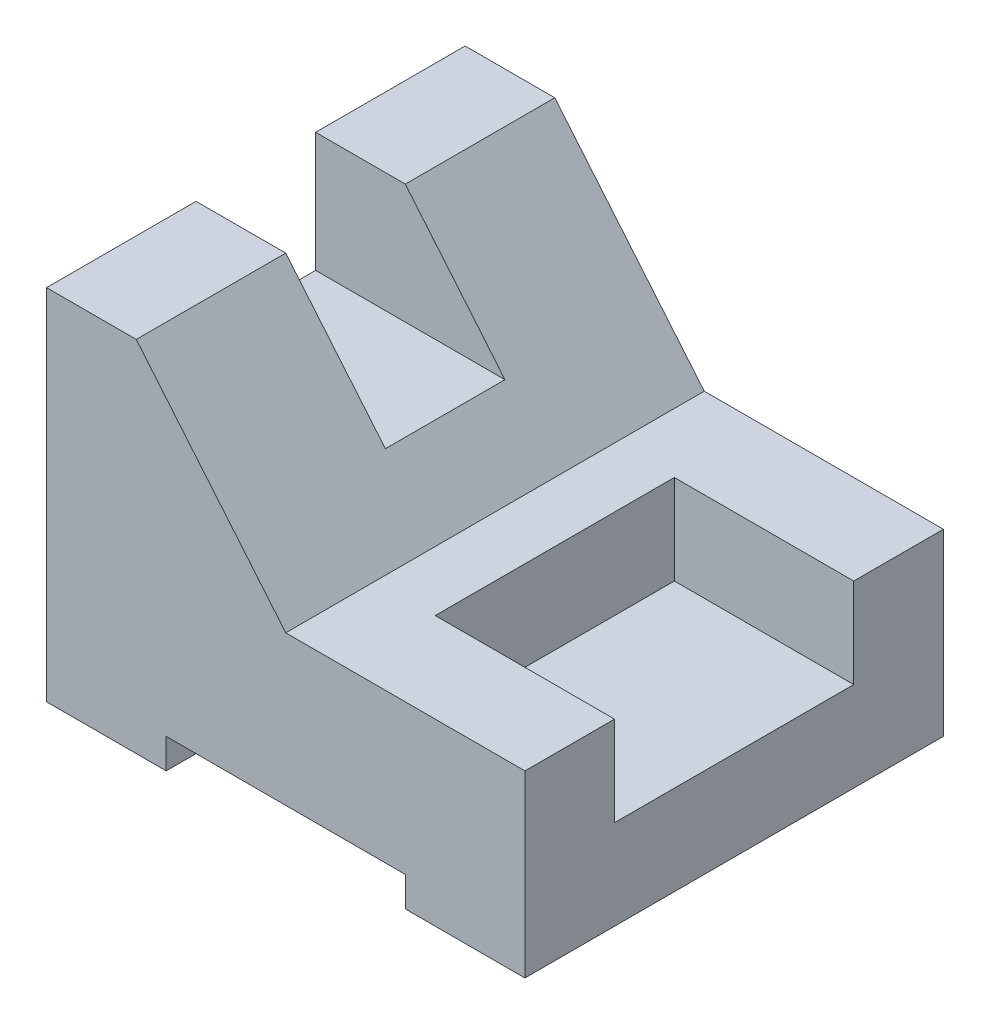
ISO-10303-21;
HEADER;
FILE_DESCRIPTION(('STEP AP214'),'2;1');
FILE_NAME('part.step','',(''),(''),'','','');
FILE_SCHEMA(('AUTOMOTIVE_DESIGN { 1 0 10303 214 1 1 1 1 }'));
ENDSEC;
DATA;
#1=APPLICATION_CONTEXT('core data for automotive mechanical design processes');
#2=APPLICATION_PROTOCOL_DEFINITION('international standard','automotive_design',2000,#1);
#3=PRODUCT_CONTEXT('',#1,'mechanical');
#4=PRODUCT('Part','Part','',(#3));
#5=PRODUCT_RELATED_PRODUCT_CATEGORY('part','',(#4));
#6=PRODUCT_DEFINITION_FORMATION('','',#4);
#7=PRODUCT_DEFINITION_CONTEXT('part definition',#1,'design');
#8=PRODUCT_DEFINITION('design','',#6,#7);
#9=PRODUCT_DEFINITION_SHAPE('','',#8);
#10=(LENGTH_UNIT() NAMED_UNIT(*) SI_UNIT(.MILLI.,.METRE.));
#11=(NAMED_UNIT(*) PLANE_ANGLE_UNIT() SI_UNIT($,.RADIAN.));
#12=(NAMED_UNIT(*) SI_UNIT($,.STERADIAN.) SOLID_ANGLE_UNIT());
#13=UNCERTAINTY_MEASURE_WITH_UNIT(LENGTH_MEASURE(1.E-05),#10,'distance_accuracy_value','');
#14=(GEOMETRIC_REPRESENTATION_CONTEXT(3) GLOBAL_UNCERTAINTY_ASSIGNED_CONTEXT((#13)) GLOBAL_UNIT_ASSIGNED_CONTEXT((#10,
#11,#12)) REPRESENTATION_CONTEXT('',''));
#15=CARTESIAN_POINT('',(0.,0.,0.));
#16=DIRECTION('',(0.,0.,1.));
#17=DIRECTION('',(1.,0.,0.));
#18=AXIS2_PLACEMENT_3D('',#15,#16,#17);
#19=CARTESIAN_POINT('',(0.,60.,35.));
#20=DIRECTION('',(0.,-1.,0.));
#21=DIRECTION('',(0.,0.,-1.));
#22=AXIS2_PLACEMENT_3D('',#19,#20,#21);
#23=PLANE('',#22);
#24=DIRECTION('',(-1.,0.,0.));
#25=VECTOR('',#24,1.);
#26=CARTESIAN_POINT('',(15.,60.,10.));
#27=LINE('',#26,#25);
#28=CARTESIAN_POINT('',(15.,60.,10.));
#29=VERTEX_POINT('',#28);
#30=CARTESIAN_POINT('',(0.,60.,10.));
#31=VERTEX_POINT('',#30);
#32=EDGE_CURVE('E203',#29,#31,#27,.T.);
#33=ORIENTED_EDGE('',*,*,#32,.T.);
#34=DIRECTION('',(0.,0.,-1.));
#35=VECTOR('',#34,1.);
#36=CARTESIAN_POINT('',(0.,60.,35.));
#37=LINE('',#36,#35);
#38=CARTESIAN_POINT('',(0.,60.,35.));
#39=VERTEX_POINT('',#38);
#40=EDGE_CURVE('E261',#39,#31,#37,.T.);
#41=ORIENTED_EDGE('',*,*,#40,.F.);
#42=DIRECTION('',(-1.,0.,0.));
#43=VECTOR('',#42,1.);
#44=CARTESIAN_POINT('',(0.,60.,35.));
#45=LINE('',#44,#43);
#46=CARTESIAN_POINT('',(15.,60.,35.));
#47=VERTEX_POINT('',#46);
#48=EDGE_CURVE('E231',#47,#39,#45,.T.);
#49=ORIENTED_EDGE('',*,*,#48,.F.);
#50=DIRECTION('',(0.,0.,-1.));
#51=VECTOR('',#50,1.);
#52=CARTESIAN_POINT('',(15.,60.,35.));
#53=LINE('',#52,#51);
#54=EDGE_CURVE('E265',#47,#29,#53,.T.);
#55=ORIENTED_EDGE('',*,*,#54,.T.);
#56=EDGE_LOOP('',(#33,#41,#49,#55));
#57=FACE_BOUND('',#56,.T.);
#58=ADVANCED_FACE('F33',(#57),#23,.F.);
#59=CARTESIAN_POINT('',(0.,0.,35.));
#60=DIRECTION('',(0.,1.,0.));
#61=DIRECTION('',(0.,0.,1.));
#62=AXIS2_PLACEMENT_3D('',#59,#60,#61);
#63=PLANE('',#62);
#64=DIRECTION('',(1.,0.,0.));
#65=VECTOR('',#64,1.);
#66=CARTESIAN_POINT('',(0.,0.,-35.));
#67=LINE('',#66,#65);
#68=CARTESIAN_POINT('',(0.,0.,-35.));
#69=VERTEX_POINT('',#68);
#70=CARTESIAN_POINT('',(20.,0.,-35.));
#71=VERTEX_POINT('',#70);
#72=EDGE_CURVE('E210',#69,#71,#67,.T.);
#73=ORIENTED_EDGE('',*,*,#72,.T.);
#74=DIRECTION('',(0.,0.,-1.));
#75=VECTOR('',#74,1.);
#76=CARTESIAN_POINT('',(20.,0.,35.));
#77=LINE('',#76,#75);
#78=CARTESIAN_POINT('',(20.,0.,35.));
#79=VERTEX_POINT('',#78);
#80=EDGE_CURVE('E11',#79,#71,#77,.T.);
#81=ORIENTED_EDGE('',*,*,#80,.F.);
#82=DIRECTION('',(1.,0.,0.));
#83=VECTOR('',#82,1.);
#84=CARTESIAN_POINT('',(0.,0.,35.));
#85=LINE('',#84,#83);
#86=CARTESIAN_POINT('',(0.,0.,35.));
#87=VERTEX_POINT('',#86);
#88=EDGE_CURVE('E213',#87,#79,#85,.T.);
#89=ORIENTED_EDGE('',*,*,#88,.F.);
#90=DIRECTION('',(0.,0.,-1.));
#91=VECTOR('',#90,1.);
#92=CARTESIAN_POINT('',(0.,0.,35.));
#93=LINE('',#92,#91);
#94=EDGE_CURVE('E235',#87,#69,#93,.T.);
#95=ORIENTED_EDGE('',*,*,#94,.T.);
#96=EDGE_LOOP('',(#73,#81,#89,#95));
#97=FACE_BOUND('',#96,.T.);
#98=ADVANCED_FACE('F35',(#97),#63,.F.);
#99=CARTESIAN_POINT('',(20.,0.,35.));
#100=DIRECTION('',(-1.,0.,0.));
#101=DIRECTION('',(0.,0.,1.));
#102=AXIS2_PLACEMENT_3D('',#99,#100,#101);
#103=PLANE('',#102);
#104=DIRECTION('',(0.,1.,0.));
#105=VECTOR('',#104,1.);
#106=CARTESIAN_POINT('',(20.,0.,-35.));
#107=LINE('',#106,#105);
#108=CARTESIAN_POINT('',(20.,5.,-35.));
#109=VERTEX_POINT('',#108);
#110=EDGE_CURVE('E238',#71,#109,#107,.T.);
#111=ORIENTED_EDGE('',*,*,#110,.T.);
#112=DIRECTION('',(0.,0.,-1.));
#113=VECTOR('',#112,1.);
#114=CARTESIAN_POINT('',(20.,5.,35.));
#115=LINE('',#114,#113);
#116=CARTESIAN_POINT('',(20.,5.,35.));
#117=VERTEX_POINT('',#116);
#118=EDGE_CURVE('E41',#117,#109,#115,.T.);
#119=ORIENTED_EDGE('',*,*,#118,.F.);
#120=DIRECTION('',(0.,1.,0.));
#121=VECTOR('',#120,1.);
#122=CARTESIAN_POINT('',(20.,0.,35.));
#123=LINE('',#122,#121);
#124=EDGE_CURVE('E216',#79,#117,#123,.T.);
#125=ORIENTED_EDGE('',*,*,#124,.F.);
#126=ORIENTED_EDGE('',*,*,#80,.T.);
#127=EDGE_LOOP('',(#111,#119,#125,#126));
#128=FACE_BOUND('',#127,.T.);
#129=ADVANCED_FACE('F310',(#128),#103,.F.);
#130=CARTESIAN_POINT('',(20.,5.,35.));
#131=DIRECTION('',(0.,1.,0.));
#132=DIRECTION('',(0.,0.,1.));
#133=AXIS2_PLACEMENT_3D('',#130,#131,#132);
#134=PLANE('',#133);
#135=DIRECTION('',(1.,0.,0.));
#136=VECTOR('',#135,1.);
#137=CARTESIAN_POINT('',(20.,5.,-35.));
#138=LINE('',#137,#136);
#139=CARTESIAN_POINT('',(60.,5.,-35.));
#140=VERTEX_POINT('',#139);
#141=EDGE_CURVE('E240',#109,#140,#138,.T.);
#142=ORIENTED_EDGE('',*,*,#141,.T.);
#143=DIRECTION('',(0.,0.,-1.));
#144=VECTOR('',#143,1.);
#145=CARTESIAN_POINT('',(60.,5.,35.));
#146=LINE('',#145,#144);
#147=CARTESIAN_POINT('',(60.,5.,35.));
#148=VERTEX_POINT('',#147);
#149=EDGE_CURVE('E280',#148,#140,#146,.T.);
#150=ORIENTED_EDGE('',*,*,#149,.F.);
#151=DIRECTION('',(1.,0.,0.));
#152=VECTOR('',#151,1.);
#153=CARTESIAN_POINT('',(20.,5.,35.));
#154=LINE('',#153,#152);
#155=EDGE_CURVE('E219',#117,#148,#154,.T.);
#156=ORIENTED_EDGE('',*,*,#155,.F.);
#157=ORIENTED_EDGE('',*,*,#118,.T.);
#158=EDGE_LOOP('',(#142,#150,#156,#157));
#159=FACE_BOUND('',#158,.T.);
#160=ADVANCED_FACE('F287',(#159),#134,.F.);
#161=CARTESIAN_POINT('',(60.,5.,35.));
#162=DIRECTION('',(1.,0.,0.));
#163=DIRECTION('',(0.,0.,-1.));
#164=AXIS2_PLACEMENT_3D('',#161,#162,#163);
#165=PLANE('',#164);
#166=DIRECTION('',(0.,-1.,0.));
#167=VECTOR('',#166,1.);
#168=CARTESIAN_POINT('',(60.,5.,-35.));
#169=LINE('',#168,#167);
#170=CARTESIAN_POINT('',(60.,0.,-35.));
#171=VERTEX_POINT('',#170);
#172=EDGE_CURVE('E242',#140,#171,#169,.T.);
#173=ORIENTED_EDGE('',*,*,#172,.T.);
#174=DIRECTION('',(0.,0.,-1.));
#175=VECTOR('',#174,1.);
#176=CARTESIAN_POINT('',(60.,0.,35.));
#177=LINE('',#176,#175);
#178=CARTESIAN_POINT('',(60.,0.,35.));
#179=VERTEX_POINT('',#178);
#180=EDGE_CURVE('E277',#179,#171,#177,.T.);
#181=ORIENTED_EDGE('',*,*,#180,.F.);
#182=DIRECTION('',(0.,-1.,0.));
#183=VECTOR('',#182,1.);
#184=CARTESIAN_POINT('',(60.,5.,35.));
#185=LINE('',#184,#183);
#186=EDGE_CURVE('E221',#148,#179,#185,.T.);
#187=ORIENTED_EDGE('',*,*,#186,.F.);
#188=ORIENTED_EDGE('',*,*,#149,.T.);
#189=EDGE_LOOP('',(#173,#181,#187,#188));
#190=FACE_BOUND('',#189,.T.);
#191=ADVANCED_FACE('F298',(#190),#165,.F.);
#192=CARTESIAN_POINT('',(60.,0.,35.));
#193=DIRECTION('',(0.,1.,0.));
#194=DIRECTION('',(0.,0.,1.));
#195=AXIS2_PLACEMENT_3D('',#192,#193,#194);
#196=PLANE('',#195);
#197=DIRECTION('',(1.,0.,0.));
#198=VECTOR('',#197,1.);
#199=CARTESIAN_POINT('',(60.,0.,-35.));
#200=LINE('',#199,#198);
#201=CARTESIAN_POINT('',(80.,0.,-35.));
#202=VERTEX_POINT('',#201);
#203=EDGE_CURVE('E244',#171,#202,#200,.T.);
#204=ORIENTED_EDGE('',*,*,#203,.T.);
#205=DIRECTION('',(0.,0.,-1.));
#206=VECTOR('',#205,1.);
#207=CARTESIAN_POINT('',(80.,0.,35.));
#208=LINE('',#207,#206);
#209=CARTESIAN_POINT('',(80.,0.,35.));
#210=VERTEX_POINT('',#209);
#211=EDGE_CURVE('E274',#210,#202,#208,.T.);
#212=ORIENTED_EDGE('',*,*,#211,.F.);
#213=DIRECTION('',(1.,0.,0.));
#214=VECTOR('',#213,1.);
#215=CARTESIAN_POINT('',(60.,0.,35.));
#216=LINE('',#215,#214);
#217=EDGE_CURVE('E223',#179,#210,#216,.T.);
#218=ORIENTED_EDGE('',*,*,#217,.F.);
#219=ORIENTED_EDGE('',*,*,#180,.T.);
#220=EDGE_LOOP('',(#204,#212,#218,#219));
#221=FACE_BOUND('',#220,.T.);
#222=ADVANCED_FACE('F302',(#221),#196,.F.);
#223=CARTESIAN_POINT('',(80.,0.,35.));
#224=DIRECTION('',(-1.,0.,0.));
#225=DIRECTION('',(0.,0.,1.));
#226=AXIS2_PLACEMENT_3D('',#223,#224,#225);
#227=PLANE('',#226);
#228=DIRECTION('',(0.,0.,-1.));
#229=VECTOR('',#228,1.);
#230=CARTESIAN_POINT('',(80.,30.,35.));
#231=LINE('',#230,#229);
#232=CARTESIAN_POINT('',(80.,30.,-20.));
#233=VERTEX_POINT('',#232);
#234=CARTESIAN_POINT('',(80.,30.,-35.));
#235=VERTEX_POINT('',#234);
#236=EDGE_CURVE('E271',#233,#235,#231,.T.);
#237=ORIENTED_EDGE('',*,*,#236,.F.);
#238=DIRECTION('',(0.,-1.,0.));
#239=VECTOR('',#238,1.);
#240=CARTESIAN_POINT('',(80.,30.,-20.));
#241=LINE('',#240,#239);
#242=CARTESIAN_POINT('',(80.,15.,-20.));
#243=VERTEX_POINT('',#242);
#244=EDGE_CURVE('E164',#233,#243,#241,.T.);
#245=ORIENTED_EDGE('',*,*,#244,.T.);
#246=DIRECTION('',(0.,0.,1.));
#247=VECTOR('',#246,1.);
#248=CARTESIAN_POINT('',(80.,15.,-20.));
#249=LINE('',#248,#247);
#250=CARTESIAN_POINT('',(80.,15.,20.));
#251=VERTEX_POINT('',#250);
#252=EDGE_CURVE('E181',#243,#251,#249,.T.);
#253=ORIENTED_EDGE('',*,*,#252,.T.);
#254=DIRECTION('',(0.,-1.,0.));
#255=VECTOR('',#254,1.);
#256=CARTESIAN_POINT('',(80.,30.,20.));
#257=LINE('',#256,#255);
#258=CARTESIAN_POINT('',(80.,30.,20.));
#259=VERTEX_POINT('',#258);
#260=EDGE_CURVE('E336',#259,#251,#257,.T.);
#261=ORIENTED_EDGE('',*,*,#260,.F.);
#262=CARTESIAN_POINT('',(80.,30.,35.));
#263=VERTEX_POINT('',#262);
#264=EDGE_CURVE('E272',#263,#259,#231,.T.);
#265=ORIENTED_EDGE('',*,*,#264,.F.);
#266=DIRECTION('',(0.,1.,0.));
#267=VECTOR('',#266,1.);
#268=CARTESIAN_POINT('',(80.,0.,35.));
#269=LINE('',#268,#267);
#270=EDGE_CURVE('E225',#210,#263,#269,.T.);
#271=ORIENTED_EDGE('',*,*,#270,.F.);
#272=ORIENTED_EDGE('',*,*,#211,.T.);
#273=DIRECTION('',(0.,1.,0.));
#274=VECTOR('',#273,1.);
#275=CARTESIAN_POINT('',(80.,0.,-35.));
#276=LINE('',#275,#274);
#277=EDGE_CURVE('E246',#202,#235,#276,.T.);
#278=ORIENTED_EDGE('',*,*,#277,.T.);
#279=EDGE_LOOP('',(#237,#245,#253,#261,#265,#271,#272,#278));
#280=FACE_BOUND('',#279,.T.);
#281=ADVANCED_FACE('F334',(#280),#227,.F.);
#282=CARTESIAN_POINT('',(80.,30.,35.));
#283=DIRECTION('',(0.,-1.,0.));
#284=DIRECTION('',(0.,0.,-1.));
#285=AXIS2_PLACEMENT_3D('',#282,#283,#284);
#286=PLANE('',#285);
#287=DIRECTION('',(0.,0.,1.));
#288=VECTOR('',#287,1.);
#289=CARTESIAN_POINT('',(50.,30.,-20.));
#290=LINE('',#289,#288);
#291=CARTESIAN_POINT('',(50.,30.,-20.));
#292=VERTEX_POINT('',#291);
#293=CARTESIAN_POINT('',(50.,30.,20.));
#294=VERTEX_POINT('',#293);
#295=EDGE_CURVE('E172',#292,#294,#290,.T.);
#296=ORIENTED_EDGE('',*,*,#295,.F.);
#297=DIRECTION('',(1.,0.,0.));
#298=VECTOR('',#297,1.);
#299=CARTESIAN_POINT('',(50.,30.,-20.));
#300=LINE('',#299,#298);
#301=EDGE_CURVE('E158',#292,#233,#300,.T.);
#302=ORIENTED_EDGE('',*,*,#301,.T.);
#303=ORIENTED_EDGE('',*,*,#236,.T.);
#304=DIRECTION('',(-1.,0.,0.));
#305=VECTOR('',#304,1.);
#306=CARTESIAN_POINT('',(80.,30.,-35.));
#307=LINE('',#306,#305);
#308=CARTESIAN_POINT('',(40.,30.,-35.));
#309=VERTEX_POINT('',#308);
#310=EDGE_CURVE('E249',#235,#309,#307,.T.);
#311=ORIENTED_EDGE('',*,*,#310,.T.);
#312=DIRECTION('',(0.,0.,-1.));
#313=VECTOR('',#312,1.);
#314=CARTESIAN_POINT('',(40.,30.,35.));
#315=LINE('',#314,#313);
#316=CARTESIAN_POINT('',(40.,30.,35.));
#317=VERTEX_POINT('',#316);
#318=EDGE_CURVE('E268',#317,#309,#315,.T.);
#319=ORIENTED_EDGE('',*,*,#318,.F.);
#320=DIRECTION('',(-1.,0.,0.));
#321=VECTOR('',#320,1.);
#322=CARTESIAN_POINT('',(80.,30.,35.));
#323=LINE('',#322,#321);
#324=EDGE_CURVE('E227',#263,#317,#323,.T.);
#325=ORIENTED_EDGE('',*,*,#324,.F.);
#326=ORIENTED_EDGE('',*,*,#264,.T.);
#327=DIRECTION('',(1.,0.,0.));
#328=VECTOR('',#327,1.);
#329=CARTESIAN_POINT('',(50.,30.,20.));
#330=LINE('',#329,#328);
#331=EDGE_CURVE('E180',#294,#259,#330,.T.);
#332=ORIENTED_EDGE('',*,*,#331,.F.);
#333=EDGE_LOOP('',(#296,#302,#303,#311,#319,#325,#326,#332));
#334=FACE_BOUND('',#333,.T.);
#335=ADVANCED_FACE('F178',(#334),#286,.F.);
#336=CARTESIAN_POINT('',(40.,30.,35.));
#337=DIRECTION('',(-0.768221279597376,-0.64018439966448,0.));
#338=DIRECTION('',(0.64018439966448,-0.768221279597376,0.));
#339=AXIS2_PLACEMENT_3D('',#336,#337,#338);
#340=PLANE('',#339);
#341=CARTESIAN_POINT('',(15.,60.,-10.));
#342=VERTEX_POINT('',#341);
#343=CARTESIAN_POINT('',(15.,60.,-35.));
#344=VERTEX_POINT('',#343);
#345=EDGE_CURVE('E264',#342,#344,#53,.T.);
#346=ORIENTED_EDGE('',*,*,#345,.F.);
#347=DIRECTION('',(-0.64018439966448,0.768221279597376,0.));
#348=VECTOR('',#347,1.);
#349=CARTESIAN_POINT('',(31.6666666666667,40.,-10.));
#350=LINE('',#349,#348);
#351=CARTESIAN_POINT('',(31.6666666666667,40.,-10.));
#352=VERTEX_POINT('',#351);
#353=EDGE_CURVE('E192',#352,#342,#350,.T.);
#354=ORIENTED_EDGE('',*,*,#353,.F.);
#355=DIRECTION('',(0.,0.,1.));
#356=VECTOR('',#355,1.);
#357=CARTESIAN_POINT('',(31.6666666666667,40.,-10.));
#358=LINE('',#357,#356);
#359=CARTESIAN_POINT('',(31.6666666666667,40.,10.));
#360=VERTEX_POINT('',#359);
#361=EDGE_CURVE('E199',#352,#360,#358,.T.);
#362=ORIENTED_EDGE('',*,*,#361,.T.);
#363=DIRECTION('',(-0.64018439966448,0.768221279597376,0.));
#364=VECTOR('',#363,1.);
#365=CARTESIAN_POINT('',(31.6666666666667,40.,10.));
#366=LINE('',#365,#364);
#367=EDGE_CURVE('E183',#360,#29,#366,.T.);
#368=ORIENTED_EDGE('',*,*,#367,.T.);
#369=ORIENTED_EDGE('',*,*,#54,.F.);
#370=DIRECTION('',(-0.64018439966448,0.768221279597376,0.));
#371=VECTOR('',#370,1.);
#372=CARTESIAN_POINT('',(40.,30.,35.));
#373=LINE('',#372,#371);
#374=EDGE_CURVE('E229',#317,#47,#373,.T.);
#375=ORIENTED_EDGE('',*,*,#374,.F.);
#376=ORIENTED_EDGE('',*,*,#318,.T.);
#377=DIRECTION('',(-0.64018439966448,0.768221279597376,0.));
#378=VECTOR('',#377,1.);
#379=CARTESIAN_POINT('',(40.,30.,-35.));
#380=LINE('',#379,#378);
#381=EDGE_CURVE('E251',#309,#344,#380,.T.);
#382=ORIENTED_EDGE('',*,*,#381,.T.);
#383=EDGE_LOOP('',(#346,#354,#362,#368,#369,#375,#376,#382));
#384=FACE_BOUND('',#383,.T.);
#385=ADVANCED_FACE('F328',(#384),#340,.F.);
#386=CARTESIAN_POINT('',(0.,60.,-10.));
#387=VERTEX_POINT('',#386);
#388=CARTESIAN_POINT('',(0.,60.,-35.));
#389=VERTEX_POINT('',#388);
#390=EDGE_CURVE('E260',#387,#389,#37,.T.);
#391=ORIENTED_EDGE('',*,*,#390,.F.);
#392=DIRECTION('',(-1.,0.,0.));
#393=VECTOR('',#392,1.);
#394=CARTESIAN_POINT('',(15.,60.,-10.));
#395=LINE('',#394,#393);
#396=EDGE_CURVE('E195',#342,#387,#395,.T.);
#397=ORIENTED_EDGE('',*,*,#396,.F.);
#398=ORIENTED_EDGE('',*,*,#345,.T.);
#399=DIRECTION('',(-1.,0.,0.));
#400=VECTOR('',#399,1.);
#401=CARTESIAN_POINT('',(0.,60.,-35.));
#402=LINE('',#401,#400);
#403=EDGE_CURVE('E254',#344,#389,#402,.T.);
#404=ORIENTED_EDGE('',*,*,#403,.T.);
#405=EDGE_LOOP('',(#391,#397,#398,#404));
#406=FACE_BOUND('',#405,.T.);
#407=ADVANCED_FACE('F324',(#406),#23,.F.);
#408=CARTESIAN_POINT('',(0.,0.,35.));
#409=DIRECTION('',(1.,0.,0.));
#410=DIRECTION('',(0.,0.,-1.));
#411=AXIS2_PLACEMENT_3D('',#408,#409,#410);
#412=PLANE('',#411);
#413=DIRECTION('',(0.,0.,1.));
#414=VECTOR('',#413,1.);
#415=CARTESIAN_POINT('',(0.,40.,-10.));
#416=LINE('',#415,#414);
#417=CARTESIAN_POINT('',(0.,40.,-10.));
#418=VERTEX_POINT('',#417);
#419=CARTESIAN_POINT('',(0.,40.,10.));
#420=VERTEX_POINT('',#419);
#421=EDGE_CURVE('E208',#418,#420,#416,.T.);
#422=ORIENTED_EDGE('',*,*,#421,.F.);
#423=DIRECTION('',(0.,-1.,0.));
#424=VECTOR('',#423,1.);
#425=CARTESIAN_POINT('',(0.,60.,-10.));
#426=LINE('',#425,#424);
#427=EDGE_CURVE('E197',#387,#418,#426,.T.);
#428=ORIENTED_EDGE('',*,*,#427,.F.);
#429=ORIENTED_EDGE('',*,*,#390,.T.);
#430=DIRECTION('',(0.,-1.,0.));
#431=VECTOR('',#430,1.);
#432=CARTESIAN_POINT('',(0.,0.,-35.));
#433=LINE('',#432,#431);
#434=EDGE_CURVE('E217',#389,#69,#433,.T.);
#435=ORIENTED_EDGE('',*,*,#434,.T.);
#436=ORIENTED_EDGE('',*,*,#94,.F.);
#437=DIRECTION('',(0.,-1.,0.));
#438=VECTOR('',#437,1.);
#439=CARTESIAN_POINT('',(0.,0.,35.));
#440=LINE('',#439,#438);
#441=EDGE_CURVE('E233',#39,#87,#440,.T.);
#442=ORIENTED_EDGE('',*,*,#441,.F.);
#443=ORIENTED_EDGE('',*,*,#40,.T.);
#444=DIRECTION('',(0.,-1.,0.));
#445=VECTOR('',#444,1.);
#446=CARTESIAN_POINT('',(0.,60.,10.));
#447=LINE('',#446,#445);
#448=EDGE_CURVE('E193',#31,#420,#447,.T.);
#449=ORIENTED_EDGE('',*,*,#448,.T.);
#450=EDGE_LOOP('',(#422,#428,#429,#435,#436,#442,#443,#449));
#451=FACE_BOUND('',#450,.T.);
#452=ADVANCED_FACE('F318',(#451),#412,.F.);
#453=CARTESIAN_POINT('',(0.,0.,35.));
#454=DIRECTION('',(0.,0.,1.));
#455=DIRECTION('',(1.,0.,0.));
#456=AXIS2_PLACEMENT_3D('',#453,#454,#455);
#457=PLANE('',#456);
#458=ORIENTED_EDGE('',*,*,#88,.T.);
#459=ORIENTED_EDGE('',*,*,#124,.T.);
#460=ORIENTED_EDGE('',*,*,#155,.T.);
#461=ORIENTED_EDGE('',*,*,#186,.T.);
#462=ORIENTED_EDGE('',*,*,#217,.T.);
#463=ORIENTED_EDGE('',*,*,#270,.T.);
#464=ORIENTED_EDGE('',*,*,#324,.T.);
#465=ORIENTED_EDGE('',*,*,#374,.T.);
#466=ORIENTED_EDGE('',*,*,#48,.T.);
#467=ORIENTED_EDGE('',*,*,#441,.T.);
#468=EDGE_LOOP('',(#458,#459,#460,#461,#462,#463,#464,#465,#466,#467));
#469=FACE_BOUND('',#468,.T.);
#470=ADVANCED_FACE('F306',(#469),#457,.T.);
#471=CARTESIAN_POINT('',(0.,0.,-35.));
#472=DIRECTION('',(0.,0.,1.));
#473=DIRECTION('',(1.,0.,0.));
#474=AXIS2_PLACEMENT_3D('',#471,#472,#473);
#475=PLANE('',#474);
#476=ORIENTED_EDGE('',*,*,#72,.F.);
#477=ORIENTED_EDGE('',*,*,#434,.F.);
#478=ORIENTED_EDGE('',*,*,#403,.F.);
#479=ORIENTED_EDGE('',*,*,#381,.F.);
#480=ORIENTED_EDGE('',*,*,#310,.F.);
#481=ORIENTED_EDGE('',*,*,#277,.F.);
#482=ORIENTED_EDGE('',*,*,#203,.F.);
#483=ORIENTED_EDGE('',*,*,#172,.F.);
#484=ORIENTED_EDGE('',*,*,#141,.F.);
#485=ORIENTED_EDGE('',*,*,#110,.F.);
#486=EDGE_LOOP('',(#476,#477,#478,#479,#480,#481,#482,#483,#484,#485));
#487=FACE_BOUND('',#486,.T.);
#488=ADVANCED_FACE('F293',(#487),#475,.F.);
#489=CARTESIAN_POINT('',(0.,40.,-10.));
#490=DIRECTION('',(0.,-1.,0.));
#491=DIRECTION('',(0.,0.,-1.));
#492=AXIS2_PLACEMENT_3D('',#489,#490,#491);
#493=PLANE('',#492);
#494=DIRECTION('',(1.,0.,0.));
#495=VECTOR('',#494,1.);
#496=CARTESIAN_POINT('',(0.,40.,10.));
#497=LINE('',#496,#495);
#498=EDGE_CURVE('E56',#420,#360,#497,.T.);
#499=ORIENTED_EDGE('',*,*,#498,.T.);
#500=ORIENTED_EDGE('',*,*,#361,.F.);
#501=DIRECTION('',(1.,0.,0.));
#502=VECTOR('',#501,1.);
#503=CARTESIAN_POINT('',(0.,40.,-10.));
#504=LINE('',#503,#502);
#505=EDGE_CURVE('E189',#418,#352,#504,.T.);
#506=ORIENTED_EDGE('',*,*,#505,.F.);
#507=ORIENTED_EDGE('',*,*,#421,.T.);
#508=EDGE_LOOP('',(#499,#500,#506,#507));
#509=FACE_BOUND('',#508,.T.);
#510=ADVANCED_FACE('F343',(#509),#493,.F.);
#511=CARTESIAN_POINT('',(0.,0.,-10.));
#512=DIRECTION('',(0.,0.,-1.));
#513=DIRECTION('',(-1.,0.,0.));
#514=AXIS2_PLACEMENT_3D('',#511,#512,#513);
#515=PLANE('',#514);
#516=ORIENTED_EDGE('',*,*,#505,.T.);
#517=ORIENTED_EDGE('',*,*,#353,.T.);
#518=ORIENTED_EDGE('',*,*,#396,.T.);
#519=ORIENTED_EDGE('',*,*,#427,.T.);
#520=EDGE_LOOP('',(#516,#517,#518,#519));
#521=FACE_BOUND('',#520,.T.);
#522=ADVANCED_FACE('F345',(#521),#515,.F.);
#523=CARTESIAN_POINT('',(0.,0.,10.));
#524=DIRECTION('',(0.,0.,-1.));
#525=DIRECTION('',(-1.,0.,0.));
#526=AXIS2_PLACEMENT_3D('',#523,#524,#525);
#527=PLANE('',#526);
#528=ORIENTED_EDGE('',*,*,#498,.F.);
#529=ORIENTED_EDGE('',*,*,#448,.F.);
#530=ORIENTED_EDGE('',*,*,#32,.F.);
#531=ORIENTED_EDGE('',*,*,#367,.F.);
#532=EDGE_LOOP('',(#528,#529,#530,#531));
#533=FACE_BOUND('',#532,.T.);
#534=ADVANCED_FACE('F341',(#533),#527,.T.);
#535=CARTESIAN_POINT('',(50.,15.,-20.));
#536=DIRECTION('',(1.,0.,0.));
#537=DIRECTION('',(0.,0.,-1.));
#538=AXIS2_PLACEMENT_3D('',#535,#536,#537);
#539=PLANE('',#538);
#540=DIRECTION('',(0.,1.,0.));
#541=VECTOR('',#540,1.);
#542=CARTESIAN_POINT('',(50.,15.,20.));
#543=LINE('',#542,#541);
#544=CARTESIAN_POINT('',(50.,15.,20.));
#545=VERTEX_POINT('',#544);
#546=EDGE_CURVE('E48',#545,#294,#543,.T.);
#547=ORIENTED_EDGE('',*,*,#546,.F.);
#548=DIRECTION('',(0.,0.,1.));
#549=VECTOR('',#548,1.);
#550=CARTESIAN_POINT('',(50.,15.,-20.));
#551=LINE('',#550,#549);
#552=CARTESIAN_POINT('',(50.,15.,-20.));
#553=VERTEX_POINT('',#552);
#554=EDGE_CURVE('E175',#553,#545,#551,.T.);
#555=ORIENTED_EDGE('',*,*,#554,.F.);
#556=DIRECTION('',(0.,1.,0.));
#557=VECTOR('',#556,1.);
#558=CARTESIAN_POINT('',(50.,15.,-20.));
#559=LINE('',#558,#557);
#560=EDGE_CURVE('E162',#553,#292,#559,.T.);
#561=ORIENTED_EDGE('',*,*,#560,.T.);
#562=ORIENTED_EDGE('',*,*,#295,.T.);
#563=EDGE_LOOP('',(#547,#555,#561,#562));
#564=FACE_BOUND('',#563,.T.);
#565=ADVANCED_FACE('F171',(#564),#539,.T.);
#566=CARTESIAN_POINT('',(80.,15.,-20.));
#567=DIRECTION('',(0.,1.,0.));
#568=DIRECTION('',(-1.,0.,0.));
#569=AXIS2_PLACEMENT_3D('',#566,#567,#568);
#570=PLANE('',#569);
#571=DIRECTION('',(-1.,0.,0.));
#572=VECTOR('',#571,1.);
#573=CARTESIAN_POINT('',(80.,15.,20.));
#574=LINE('',#573,#572);
#575=EDGE_CURVE('E176',#251,#545,#574,.T.);
#576=ORIENTED_EDGE('',*,*,#575,.F.);
#577=ORIENTED_EDGE('',*,*,#252,.F.);
#578=DIRECTION('',(-1.,0.,0.));
#579=VECTOR('',#578,1.);
#580=CARTESIAN_POINT('',(80.,15.,-20.));
#581=LINE('',#580,#579);
#582=EDGE_CURVE('E448',#243,#553,#581,.T.);
#583=ORIENTED_EDGE('',*,*,#582,.T.);
#584=ORIENTED_EDGE('',*,*,#554,.T.);
#585=EDGE_LOOP('',(#576,#577,#583,#584));
#586=FACE_BOUND('',#585,.T.);
#587=ADVANCED_FACE('F416',(#586),#570,.T.);
#588=CARTESIAN_POINT('',(0.,0.,-20.));
#589=DIRECTION('',(0.,0.,-1.));
#590=DIRECTION('',(-1.,0.,0.));
#591=AXIS2_PLACEMENT_3D('',#588,#589,#590);
#592=PLANE('',#591);
#593=ORIENTED_EDGE('',*,*,#560,.F.);
#594=ORIENTED_EDGE('',*,*,#582,.F.);
#595=ORIENTED_EDGE('',*,*,#244,.F.);
#596=ORIENTED_EDGE('',*,*,#301,.F.);
#597=EDGE_LOOP('',(#593,#594,#595,#596));
#598=FACE_BOUND('',#597,.T.);
#599=ADVANCED_FACE('F160',(#598),#592,.F.);
#600=CARTESIAN_POINT('',(0.,0.,20.));
#601=DIRECTION('',(0.,0.,-1.));
#602=DIRECTION('',(-1.,0.,0.));
#603=AXIS2_PLACEMENT_3D('',#600,#601,#602);
#604=PLANE('',#603);
#605=ORIENTED_EDGE('',*,*,#546,.T.);
#606=ORIENTED_EDGE('',*,*,#331,.T.);
#607=ORIENTED_EDGE('',*,*,#260,.T.);
#608=ORIENTED_EDGE('',*,*,#575,.T.);
#609=EDGE_LOOP('',(#605,#606,#607,#608));
#610=FACE_BOUND('',#609,.T.);
#611=ADVANCED_FACE('F434',(#610),#604,.T.);
#612=CLOSED_SHELL('',(#58,#98,#129,#160,#191,#222,#281,#335,#385,#407,#452,#470,#488,#510,#522,
#534,#565,#587,#599,#611));
#613=MANIFOLD_SOLID_BREP('B2',#612);
#614=ADVANCED_BREP_SHAPE_REPRESENTATION('',(#18,#613),#14);
#615=SHAPE_DEFINITION_REPRESENTATION(#9,#614);
ENDSEC;
END-ISO-10303-21;
